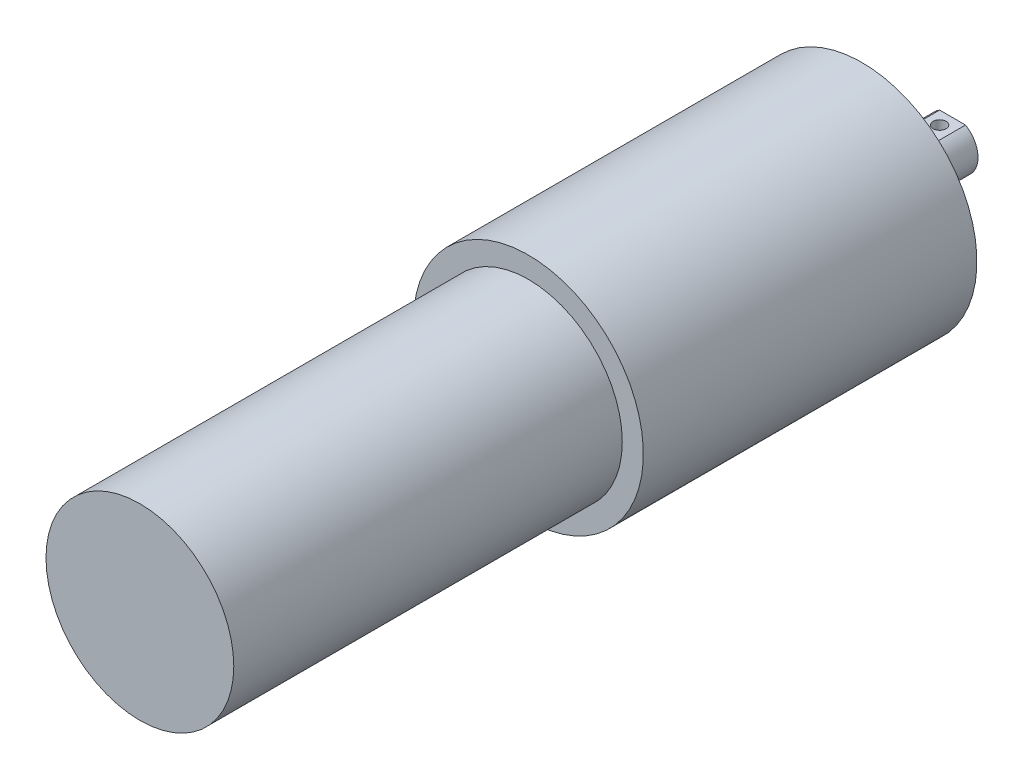
ISO-10303-21;
HEADER;
FILE_DESCRIPTION(('STEP AP214'),'2;1');
FILE_NAME('part.step','',(''),(''),'','','');
FILE_SCHEMA(('AUTOMOTIVE_DESIGN { 1 0 10303 214 1 1 1 1 }'));
ENDSEC;
DATA;
#1=APPLICATION_CONTEXT('core data for automotive mechanical design processes');
#2=APPLICATION_PROTOCOL_DEFINITION('international standard','automotive_design',2000,#1);
#3=PRODUCT_CONTEXT('',#1,'mechanical');
#4=PRODUCT('Part','Part','',(#3));
#5=PRODUCT_RELATED_PRODUCT_CATEGORY('part','',(#4));
#6=PRODUCT_DEFINITION_FORMATION('','',#4);
#7=PRODUCT_DEFINITION_CONTEXT('part definition',#1,'design');
#8=PRODUCT_DEFINITION('design','',#6,#7);
#9=PRODUCT_DEFINITION_SHAPE('','',#8);
#10=(LENGTH_UNIT() NAMED_UNIT(*) SI_UNIT(.MILLI.,.METRE.));
#11=(NAMED_UNIT(*) PLANE_ANGLE_UNIT() SI_UNIT($,.RADIAN.));
#12=(NAMED_UNIT(*) SI_UNIT($,.STERADIAN.) SOLID_ANGLE_UNIT());
#13=UNCERTAINTY_MEASURE_WITH_UNIT(LENGTH_MEASURE(1.E-05),#10,'distance_accuracy_value','');
#14=(GEOMETRIC_REPRESENTATION_CONTEXT(3) GLOBAL_UNCERTAINTY_ASSIGNED_CONTEXT((#13)) GLOBAL_UNIT_ASSIGNED_CONTEXT((#10,
#11,#12)) REPRESENTATION_CONTEXT('',''));
#15=CARTESIAN_POINT('',(0.,0.,0.));
#16=DIRECTION('',(0.,0.,1.));
#17=DIRECTION('',(1.,0.,0.));
#18=AXIS2_PLACEMENT_3D('',#15,#16,#17);
#19=CARTESIAN_POINT('',(0.,0.,-65.4177));
#20=DIRECTION('',(0.,0.,-1.));
#21=DIRECTION('',(-1.,0.,0.));
#22=AXIS2_PLACEMENT_3D('',#19,#20,#21);
#23=PLANE('',#22);
#24=CARTESIAN_POINT('',(0.,0.,-65.4177));
#25=DIRECTION('',(0.,0.,-1.));
#26=DIRECTION('',(-1.,0.,0.));
#27=AXIS2_PLACEMENT_3D('',#24,#25,#26);
#28=CIRCLE('',#27,22.54885);
#29=CARTESIAN_POINT('',(-22.54885,0.,-65.4177));
#30=VERTEX_POINT('',#29);
#31=EDGE_CURVE('E79',#30,#30,#28,.T.);
#32=ORIENTED_EDGE('',*,*,#31,.T.);
#33=EDGE_LOOP('',(#32));
#34=FACE_BOUND('',#33,.T.);
#35=CARTESIAN_POINT('',(0.,0.,-65.4177));
#36=DIRECTION('',(0.,0.,-1.));
#37=DIRECTION('',(-1.,0.,0.));
#38=AXIS2_PLACEMENT_3D('',#35,#36,#37);
#39=CIRCLE('',#38,4.9911);
#40=CARTESIAN_POINT('',(-4.9911,0.,-65.4177));
#41=VERTEX_POINT('',#40);
#42=EDGE_CURVE('E73',#41,#41,#39,.T.);
#43=ORIENTED_EDGE('',*,*,#42,.F.);
#44=EDGE_LOOP('',(#43));
#45=FACE_BOUND('',#44,.T.);
#46=ADVANCED_FACE('F35',(#34,#45),#23,.T.);
#47=CARTESIAN_POINT('',(0.,0.,76.2));
#48=DIRECTION('',(0.,0.,-1.));
#49=DIRECTION('',(-1.,0.,0.));
#50=AXIS2_PLACEMENT_3D('',#47,#48,#49);
#51=CYLINDRICAL_SURFACE('',#50,18.415);
#52=CARTESIAN_POINT('',(0.,0.,76.2));
#53=DIRECTION('',(0.,0.,1.));
#54=DIRECTION('',(1.,0.,0.));
#55=AXIS2_PLACEMENT_3D('',#52,#53,#54);
#56=CIRCLE('',#55,18.415);
#57=CARTESIAN_POINT('',(18.415,0.,76.2));
#58=VERTEX_POINT('',#57);
#59=EDGE_CURVE('E43',#58,#58,#56,.T.);
#60=ORIENTED_EDGE('',*,*,#59,.F.);
#61=EDGE_LOOP('',(#60));
#62=FACE_BOUND('',#61,.T.);
#63=CARTESIAN_POINT('',(0.,0.,0.));
#64=DIRECTION('',(0.,0.,-1.));
#65=DIRECTION('',(-1.,0.,0.));
#66=AXIS2_PLACEMENT_3D('',#63,#64,#65);
#67=CIRCLE('',#66,18.415);
#68=CARTESIAN_POINT('',(-18.415,0.,0.));
#69=VERTEX_POINT('',#68);
#70=EDGE_CURVE('E86',#69,#69,#67,.T.);
#71=ORIENTED_EDGE('',*,*,#70,.F.);
#72=EDGE_LOOP('',(#71));
#73=FACE_BOUND('',#72,.T.);
#74=ADVANCED_FACE('F37',(#62,#73),#51,.T.);
#75=CARTESIAN_POINT('',(0.,0.,76.2));
#76=DIRECTION('',(0.,0.,1.));
#77=DIRECTION('',(1.,0.,0.));
#78=AXIS2_PLACEMENT_3D('',#75,#76,#77);
#79=PLANE('',#78);
#80=ORIENTED_EDGE('',*,*,#59,.T.);
#81=EDGE_LOOP('',(#80));
#82=FACE_BOUND('',#81,.T.);
#83=ADVANCED_FACE('F92',(#82),#79,.T.);
#84=CARTESIAN_POINT('',(0.,0.,0.));
#85=DIRECTION('',(0.,0.,-1.));
#86=DIRECTION('',(-1.,0.,0.));
#87=AXIS2_PLACEMENT_3D('',#84,#85,#86);
#88=PLANE('',#87);
#89=CARTESIAN_POINT('',(0.,0.,0.));
#90=DIRECTION('',(0.,0.,-1.));
#91=DIRECTION('',(-1.,0.,0.));
#92=AXIS2_PLACEMENT_3D('',#89,#90,#91);
#93=CIRCLE('',#92,22.54885);
#94=CARTESIAN_POINT('',(-22.54885,0.,0.));
#95=VERTEX_POINT('',#94);
#96=EDGE_CURVE('E76',#95,#95,#93,.T.);
#97=ORIENTED_EDGE('',*,*,#96,.F.);
#98=EDGE_LOOP('',(#97));
#99=FACE_BOUND('',#98,.T.);
#100=ORIENTED_EDGE('',*,*,#70,.T.);
#101=EDGE_LOOP('',(#100));
#102=FACE_BOUND('',#101,.T.);
#103=ADVANCED_FACE('F98',(#99,#102),#88,.F.);
#104=CARTESIAN_POINT('',(0.,0.,-65.4177));
#105=DIRECTION('',(0.,0.,1.));
#106=DIRECTION('',(1.,0.,0.));
#107=AXIS2_PLACEMENT_3D('',#104,#105,#106);
#108=CYLINDRICAL_SURFACE('',#107,22.54885);
#109=ORIENTED_EDGE('',*,*,#31,.F.);
#110=EDGE_LOOP('',(#109));
#111=FACE_BOUND('',#110,.T.);
#112=ORIENTED_EDGE('',*,*,#96,.T.);
#113=EDGE_LOOP('',(#112));
#114=FACE_BOUND('',#113,.T.);
#115=ADVANCED_FACE('F100',(#111,#114),#108,.T.);
#116=CARTESIAN_POINT('',(0.,0.,-83.1977));
#117=DIRECTION('',(0.,0.,1.));
#118=DIRECTION('',(1.,0.,0.));
#119=AXIS2_PLACEMENT_3D('',#116,#117,#118);
#120=CYLINDRICAL_SURFACE('',#119,4.9911);
#121=CARTESIAN_POINT('',(-1.27000000000001,-4.826818746338,-80.6577));
#122=CARTESIAN_POINT('',(-1.26999808357068,-4.82682005778884,-80.7277859862628));
#123=CARTESIAN_POINT('',(-1.26417860838279,-4.8283619059416,-80.7978929288079));
#124=CARTESIAN_POINT('',(-1.2410934031436,-4.83434625392599,-80.936090579887));
#125=CARTESIAN_POINT('',(-1.22382125350408,-4.83879038055589,-81.0041801352367));
#126=CARTESIAN_POINT('',(-1.17842834647708,-4.85004410616705,-81.1363240203403));
#127=CARTESIAN_POINT('',(-1.15032191868725,-4.85685057948943,-81.200383550641));
#128=CARTESIAN_POINT('',(-1.0841022738673,-4.87205816548215,-81.3228858661124));
#129=CARTESIAN_POINT('',(-1.04598853868272,-4.88045936071714,-81.3813283602323));
#130=CARTESIAN_POINT('',(-0.959908117596491,-4.89812417874469,-81.4922695186842));
#131=CARTESIAN_POINT('',(-0.911754967707344,-4.90740198165571,-81.5446212749347));
#132=CARTESIAN_POINT('',(-0.807364079672892,-4.9256517932966,-81.6405994921582));
#133=CARTESIAN_POINT('',(-0.751125565650392,-4.93462377257709,-81.6842251148034));
#134=CARTESIAN_POINT('',(-0.631150719257849,-4.95140827784066,-81.7621167633038));
#135=CARTESIAN_POINT('',(-0.567317555609854,-4.95920212061969,-81.7962380166846));
#136=CARTESIAN_POINT('',(-0.434589878929326,-4.97259018167173,-81.8532102889998));
#137=CARTESIAN_POINT('',(-0.365696142234996,-4.97818473650269,-81.8760630324951));
#138=CARTESIAN_POINT('',(-0.226334990844773,-4.98644361723642,-81.9093777445673));
#139=CARTESIAN_POINT('',(-0.155930794241021,-4.98916688316601,-81.9200893002667));
#140=CARTESIAN_POINT('',(-0.0142755711504605,-4.99158191811014,-81.9296014868517));
#141=CARTESIAN_POINT('',(0.056975324150981,-4.99127415078328,-81.9284039394783));
#142=CARTESIAN_POINT('',(0.196568746881573,-4.98770549089673,-81.9143104432746));
#143=CARTESIAN_POINT('',(0.264940482136293,-4.98451262584196,-81.9016839646715));
#144=CARTESIAN_POINT('',(0.398560893804905,-4.97561201017486,-81.8655247399849));
#145=CARTESIAN_POINT('',(0.46380940048043,-4.96990412305006,-81.8419914018863));
#146=CARTESIAN_POINT('',(0.590035358489603,-4.95651156854554,-81.7844714810043));
#147=CARTESIAN_POINT('',(0.650967565289923,-4.94880905159732,-81.7503899369574));
#148=CARTESIAN_POINT('',(0.766341676363815,-4.93226130318528,-81.672813306752));
#149=CARTESIAN_POINT('',(0.820782412690048,-4.92341586668176,-81.6293165305535));
#150=CARTESIAN_POINT('',(0.923235697277951,-4.90525240342698,-81.5327032388841));
#151=CARTESIAN_POINT('',(0.971025422169768,-4.89592807933958,-81.479351356555));
#152=CARTESIAN_POINT('',(1.05703052344444,-4.87808368264372,-81.3652932548358));
#153=CARTESIAN_POINT('',(1.09524541865102,-4.86956365046778,-81.3045866660674));
#154=CARTESIAN_POINT('',(1.16116569787481,-4.85426922554002,-81.1770933156161));
#155=CARTESIAN_POINT('',(1.18881564168966,-4.84750409969953,-81.1102766997696));
#156=CARTESIAN_POINT('',(1.23241979199822,-4.83660328445065,-80.9727293032324));
#157=CARTESIAN_POINT('',(1.24837660380783,-4.83246700934224,-80.9019993982308));
#158=CARTESIAN_POINT('',(1.26776808279987,-4.82741563934221,-80.7607041951338));
#159=CARTESIAN_POINT('',(1.27153297323619,-4.8264156218139,-80.6901872004735));
#160=CARTESIAN_POINT('',(1.26733930336727,-4.82751852065904,-80.5495321330898));
#161=CARTESIAN_POINT('',(1.25938186561078,-4.82962113991912,-80.4793940247291));
#162=CARTESIAN_POINT('',(1.23225938697295,-4.83661085161218,-80.3427258823976));
#163=CARTESIAN_POINT('',(1.21328823096521,-4.84144973761196,-80.2761546691327));
#164=CARTESIAN_POINT('',(1.1648925947195,-4.85332064674614,-80.1471377360596));
#165=CARTESIAN_POINT('',(1.13546684224224,-4.86035293678723,-80.0846925194489));
#166=CARTESIAN_POINT('',(1.0663115743672,-4.87599591477716,-79.9643055894331));
#167=CARTESIAN_POINT('',(1.02638554581773,-4.88463567143325,-79.9064806231164));
#168=CARTESIAN_POINT('',(0.937610272023481,-4.90244955691963,-79.7982299505713));
#169=CARTESIAN_POINT('',(0.888759505298871,-4.91162377668272,-79.7478055086235));
#170=CARTESIAN_POINT('',(0.782002808902362,-4.92976188628929,-79.6544409324974));
#171=CARTESIAN_POINT('',(0.723894309700733,-4.93871408905984,-79.6117297230566));
#172=CARTESIAN_POINT('',(0.601138772364,-4.95515290888995,-79.5366706619098));
#173=CARTESIAN_POINT('',(0.536492078362811,-4.96263960302484,-79.5043222651365));
#174=CARTESIAN_POINT('',(0.402945379828554,-4.97525627165747,-79.4511926605092));
#175=CARTESIAN_POINT('',(0.334080566690165,-4.98040335210073,-79.4303272506807));
#176=CARTESIAN_POINT('',(0.193673102523858,-4.98783585587645,-79.4005051681158));
#177=CARTESIAN_POINT('',(0.122130991111938,-4.99012185270202,-79.3915461087754));
#178=CARTESIAN_POINT('',(-0.0194527941000905,-4.99155024827979,-79.3859293130945));
#179=CARTESIAN_POINT('',(-0.0894804164144887,-4.99077884513022,-79.388934282667));
#180=CARTESIAN_POINT('',(-0.227998299224024,-4.9863712542346,-79.4063849120539));
#181=CARTESIAN_POINT('',(-0.29648860840821,-4.9827351573498,-79.4208302090086));
#182=CARTESIAN_POINT('',(-0.429620805788195,-4.97302106986576,-79.4605678879519));
#183=CARTESIAN_POINT('',(-0.494282585994832,-4.96695726314113,-79.4857973206498));
#184=CARTESIAN_POINT('',(-0.618491970525276,-4.95302507699537,-79.5463302937617));
#185=CARTESIAN_POINT('',(-0.678038908906753,-4.94515646307993,-79.5816351433964));
#186=CARTESIAN_POINT('',(-0.791920125919968,-4.92821881724513,-79.6623345947252));
#187=CARTESIAN_POINT('',(-0.846089495635454,-4.91912495276825,-79.7079566972893));
#188=CARTESIAN_POINT('',(-0.946118030842755,-4.90087041510488,-79.8075565888924));
#189=CARTESIAN_POINT('',(-0.991975066390761,-4.89170972541893,-79.8615365129793));
#190=CARTESIAN_POINT('',(-1.07495763343158,-4.87415464525806,-79.9775873927694));
#191=CARTESIAN_POINT('',(-1.11189535085392,-4.86577869299696,-80.0397956617849));
#192=CARTESIAN_POINT('',(-1.1747337246253,-4.85099259830768,-80.1697438224416));
#193=CARTESIAN_POINT('',(-1.20064220267767,-4.84458106366348,-80.2374797532197));
#194=CARTESIAN_POINT('',(-1.23695016178597,-4.83542285129093,-80.3638364485412));
#195=CARTESIAN_POINT('',(-1.24931630223336,-4.83222106046318,-80.4218668089568));
#196=CARTESIAN_POINT('',(-1.26584165332834,-4.82791855027361,-80.5391598586685));
#197=CARTESIAN_POINT('',(-1.27000162088419,-4.82681763713461,-80.5984224338));
#198=CARTESIAN_POINT('',(-1.27000000000001,-4.826818746338,-80.6577));
#199=B_SPLINE_CURVE_WITH_KNOTS('',3,(#121,#122,#123,#124,#125,#126,#127,#128,#129,#130,#131,
#132,#133,#134,#135,#136,#137,#138,#139,#140,#141,#142,#143,#144,#145,#146,#147,#148,#149,#150,
#151,#152,#153,#154,#155,#156,#157,#158,#159,#160,#161,#162,#163,#164,#165,#166,#167,#168,#169,
#170,#171,#172,#173,#174,#175,#176,#177,#178,#179,#180,#181,#182,#183,#184,#185,#186,#187,#188,
#189,#190,#191,#192,#193,#194,#195,#196,#197,#198),.UNSPECIFIED.,.T.,.F.,(4,2,2,2,2,2,2,2,2,2,2,
2,2,2,2,2,2,2,2,2,2,2,2,2,2,2,2,2,2,2,2,2,2,2,2,2,2,2,4),(0.,0.210040199627265,
0.420198233105384,0.63007925652024,0.839971149216487,1.05417838160802,1.26840618321238,
1.48573798992596,1.70303652530474,1.91578207641511,2.12849508424196,2.33631979222167,
2.54415578207427,2.75392011240584,2.9637221268335,3.17940197492544,3.39509265968244,
3.61190013834702,3.82865929600928,4.03949606980851,4.25031265485604,4.45752596534282,
4.66476450064454,4.87619798676524,5.0876675515331,5.30464046783937,5.52160196984542,
5.73695059559544,5.9522560486328,6.1615351213354,6.37080755647146,6.5788747568031,
6.78696900614166,7.00019877369764,7.21348310202711,7.43092875761381,7.6482199473995,
7.82588485685526,8.00353337836405),.UNSPECIFIED.);
#200=CARTESIAN_POINT('',(-1.27000000000001,-4.826818746338,-80.6577));
#201=VERTEX_POINT('',#200);
#202=EDGE_CURVE('E66',#201,#201,#199,.T.);
#203=ORIENTED_EDGE('',*,*,#202,.F.);
#204=EDGE_LOOP('',(#203));
#205=FACE_BOUND('',#204,.T.);
#206=CARTESIAN_POINT('',(0.,0.,-83.1977));
#207=DIRECTION('',(0.,0.,-1.));
#208=DIRECTION('',(-1.,0.,0.));
#209=AXIS2_PLACEMENT_3D('',#206,#207,#208);
#210=CIRCLE('',#209,4.9911);
#211=CARTESIAN_POINT('',(2.54,4.29644960519729,-83.1977));
#212=VERTEX_POINT('',#211);
#213=CARTESIAN_POINT('',(-2.54,4.2964496051973,-83.1977));
#214=VERTEX_POINT('',#213);
#215=EDGE_CURVE('E72',#212,#214,#210,.T.);
#216=ORIENTED_EDGE('',*,*,#215,.F.);
#217=DIRECTION('',(0.,0.,-1.));
#218=VECTOR('',#217,1.);
#219=CARTESIAN_POINT('',(2.54,4.29644960519729,-75.5777));
#220=LINE('',#219,#218);
#221=CARTESIAN_POINT('',(2.54,4.29644960519729,-75.5777));
#222=VERTEX_POINT('',#221);
#223=EDGE_CURVE('E50',#222,#212,#220,.T.);
#224=ORIENTED_EDGE('',*,*,#223,.F.);
#225=CARTESIAN_POINT('',(0.,0.,-75.5777));
#226=DIRECTION('',(0.,0.,-1.));
#227=DIRECTION('',(-1.,0.,0.));
#228=AXIS2_PLACEMENT_3D('',#225,#226,#227);
#229=CIRCLE('',#228,4.9911);
#230=CARTESIAN_POINT('',(-2.54,4.2964496051973,-75.5777));
#231=VERTEX_POINT('',#230);
#232=EDGE_CURVE('E11',#231,#222,#229,.T.);
#233=ORIENTED_EDGE('',*,*,#232,.F.);
#234=DIRECTION('',(0.,0.,-1.));
#235=VECTOR('',#234,1.);
#236=CARTESIAN_POINT('',(-2.54,4.2964496051973,-75.5777));
#237=LINE('',#236,#235);
#238=EDGE_CURVE('E56',#231,#214,#237,.T.);
#239=ORIENTED_EDGE('',*,*,#238,.T.);
#240=EDGE_LOOP('',(#216,#224,#233,#239));
#241=FACE_BOUND('',#240,.T.);
#242=ORIENTED_EDGE('',*,*,#42,.T.);
#243=EDGE_LOOP('',(#242));
#244=FACE_BOUND('',#243,.T.);
#245=ADVANCED_FACE('F70',(#205,#241,#244),#120,.T.);
#246=CARTESIAN_POINT('',(0.,0.,-83.1977));
#247=DIRECTION('',(0.,0.,-1.));
#248=DIRECTION('',(-1.,0.,0.));
#249=AXIS2_PLACEMENT_3D('',#246,#247,#248);
#250=PLANE('',#249);
#251=DIRECTION('',(-1.,0.,0.));
#252=VECTOR('',#251,1.);
#253=CARTESIAN_POINT('',(2.54,4.29644960519729,-83.1977));
#254=LINE('',#253,#252);
#255=EDGE_CURVE('E60',#212,#214,#254,.T.);
#256=ORIENTED_EDGE('',*,*,#255,.F.);
#257=ORIENTED_EDGE('',*,*,#215,.T.);
#258=EDGE_LOOP('',(#256,#257));
#259=FACE_BOUND('',#258,.T.);
#260=ADVANCED_FACE('F75',(#259),#250,.T.);
#261=CARTESIAN_POINT('',(0.,0.,-75.5777));
#262=DIRECTION('',(0.,0.,-1.));
#263=DIRECTION('',(-1.,0.,0.));
#264=AXIS2_PLACEMENT_3D('',#261,#262,#263);
#265=PLANE('',#264);
#266=ORIENTED_EDGE('',*,*,#232,.T.);
#267=DIRECTION('',(-1.,0.,0.));
#268=VECTOR('',#267,1.);
#269=CARTESIAN_POINT('',(2.54,4.29644960519729,-75.5777));
#270=LINE('',#269,#268);
#271=EDGE_CURVE('E65',#222,#231,#270,.T.);
#272=ORIENTED_EDGE('',*,*,#271,.T.);
#273=EDGE_LOOP('',(#266,#272));
#274=FACE_BOUND('',#273,.T.);
#275=ADVANCED_FACE('F122',(#274),#265,.T.);
#276=CARTESIAN_POINT('',(2.54,4.29644960519729,-75.5777));
#277=DIRECTION('',(0.,-1.,0.));
#278=DIRECTION('',(1.,0.,0.));
#279=AXIS2_PLACEMENT_3D('',#276,#277,#278);
#280=PLANE('',#279);
#281=CARTESIAN_POINT('',(0.,4.2964496051973,-80.6577));
#282=DIRECTION('',(0.,1.,0.));
#283=DIRECTION('',(-1.,0.,0.));
#284=AXIS2_PLACEMENT_3D('',#281,#282,#283);
#285=CIRCLE('',#284,1.27000000000001);
#286=CARTESIAN_POINT('',(-1.27000000000001,4.2964496051973,-80.6577));
#287=VERTEX_POINT('',#286);
#288=EDGE_CURVE('E141',#287,#287,#285,.T.);
#289=ORIENTED_EDGE('',*,*,#288,.F.);
#290=EDGE_LOOP('',(#289));
#291=FACE_BOUND('',#290,.T.);
#292=ORIENTED_EDGE('',*,*,#255,.T.);
#293=ORIENTED_EDGE('',*,*,#238,.F.);
#294=ORIENTED_EDGE('',*,*,#271,.F.);
#295=ORIENTED_EDGE('',*,*,#223,.T.);
#296=EDGE_LOOP('',(#292,#293,#294,#295));
#297=FACE_BOUND('',#296,.T.);
#298=ADVANCED_FACE('F61',(#291,#297),#280,.F.);
#299=CARTESIAN_POINT('',(0.,-22.54985,-80.6577));
#300=DIRECTION('',(0.,1.,0.));
#301=DIRECTION('',(-1.,0.,0.));
#302=AXIS2_PLACEMENT_3D('',#299,#300,#301);
#303=CYLINDRICAL_SURFACE('',#302,1.27000000000001);
#304=ORIENTED_EDGE('',*,*,#288,.T.);
#305=EDGE_LOOP('',(#304));
#306=FACE_BOUND('',#305,.T.);
#307=ORIENTED_EDGE('',*,*,#202,.T.);
#308=EDGE_LOOP('',(#307));
#309=FACE_BOUND('',#308,.T.);
#310=ADVANCED_FACE('F125',(#306,#309),#303,.F.);
#311=CLOSED_SHELL('',(#46,#74,#83,#103,#115,#245,#260,#275,#298,#310));
#312=MANIFOLD_SOLID_BREP('B2',#311);
#313=ADVANCED_BREP_SHAPE_REPRESENTATION('',(#18,#312),#14);
#314=SHAPE_DEFINITION_REPRESENTATION(#9,#313);
ENDSEC;
END-ISO-10303-21;
